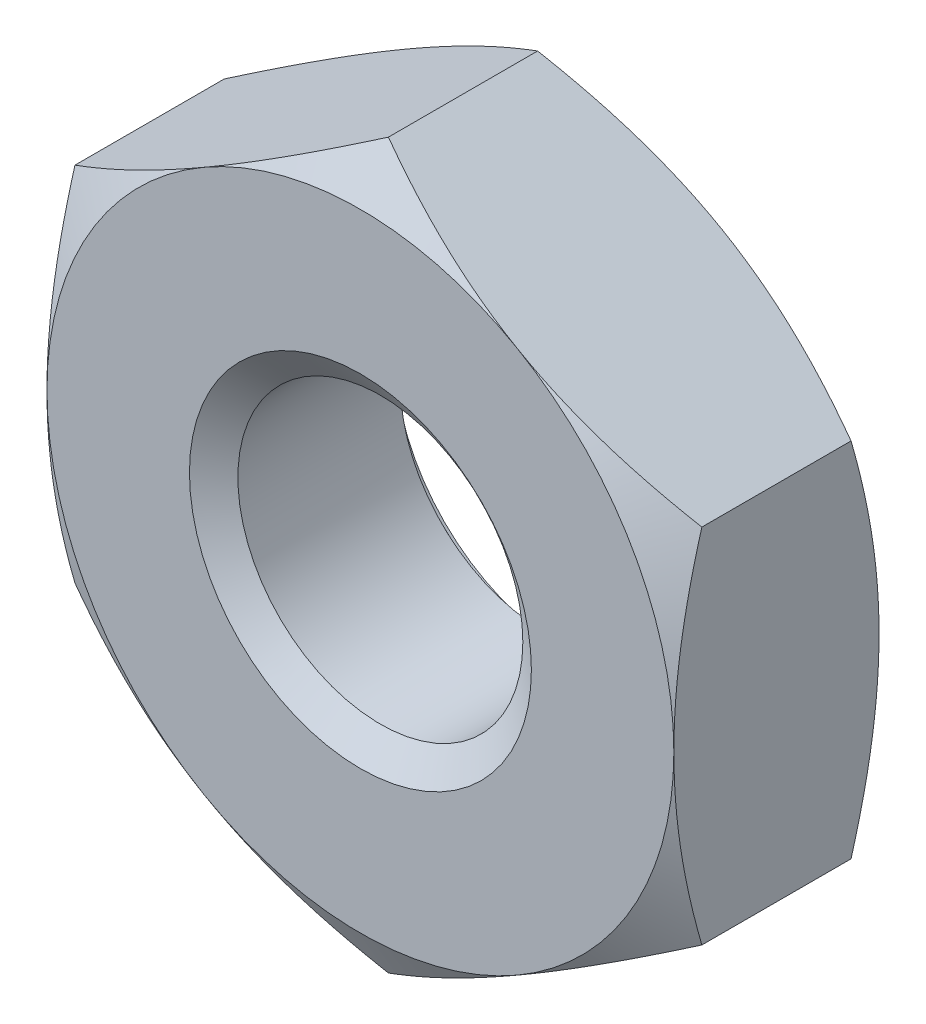
ISO-10303-21;
HEADER;
FILE_DESCRIPTION(('STEP AP214'),'2;1');
FILE_NAME('part.step','',(''),(''),'','','');
FILE_SCHEMA(('AUTOMOTIVE_DESIGN { 1 0 10303 214 1 1 1 1 }'));
ENDSEC;
DATA;
#1=APPLICATION_CONTEXT('core data for automotive mechanical design processes');
#2=APPLICATION_PROTOCOL_DEFINITION('international standard','automotive_design',2000,#1);
#3=PRODUCT_CONTEXT('',#1,'mechanical');
#4=PRODUCT('Part','Part','',(#3));
#5=PRODUCT_RELATED_PRODUCT_CATEGORY('part','',(#4));
#6=PRODUCT_DEFINITION_FORMATION('','',#4);
#7=PRODUCT_DEFINITION_CONTEXT('part definition',#1,'design');
#8=PRODUCT_DEFINITION('design','',#6,#7);
#9=PRODUCT_DEFINITION_SHAPE('','',#8);
#10=(LENGTH_UNIT() NAMED_UNIT(*) SI_UNIT(.MILLI.,.METRE.));
#11=(NAMED_UNIT(*) PLANE_ANGLE_UNIT() SI_UNIT($,.RADIAN.));
#12=(NAMED_UNIT(*) SI_UNIT($,.STERADIAN.) SOLID_ANGLE_UNIT());
#13=UNCERTAINTY_MEASURE_WITH_UNIT(LENGTH_MEASURE(1.E-05),#10,'distance_accuracy_value','');
#14=(GEOMETRIC_REPRESENTATION_CONTEXT(3) GLOBAL_UNCERTAINTY_ASSIGNED_CONTEXT((#13)) GLOBAL_UNIT_ASSIGNED_CONTEXT((#10,
#11,#12)) REPRESENTATION_CONTEXT('',''));
#15=CARTESIAN_POINT('',(0.,0.,0.));
#16=DIRECTION('',(0.,0.,1.));
#17=DIRECTION('',(1.,0.,0.));
#18=AXIS2_PLACEMENT_3D('',#15,#16,#17);
#19=CARTESIAN_POINT('',(0.,0.,-1.8));
#20=DIRECTION('',(0.,0.,1.));
#21=DIRECTION('',(1.,0.,0.));
#22=AXIS2_PLACEMENT_3D('',#19,#20,#21);
#23=CYLINDRICAL_SURFACE('',#22,1.25);
#24=CARTESIAN_POINT('',(0.,0.,-0.175051884552433));
#25=DIRECTION('',(0.,0.,1.));
#26=DIRECTION('',(1.,0.,0.));
#27=AXIS2_PLACEMENT_3D('',#24,#25,#26);
#28=CIRCLE('',#27,1.25);
#29=CARTESIAN_POINT('',(1.25,0.,-0.175051884552433));
#30=VERTEX_POINT('',#29);
#31=EDGE_CURVE('E166',#30,#30,#28,.F.);
#32=ORIENTED_EDGE('',*,*,#31,.F.);
#33=EDGE_LOOP('',(#32));
#34=FACE_BOUND('',#33,.T.);
#35=CARTESIAN_POINT('',(0.,0.,-1.59954811544757));
#36=DIRECTION('',(0.,0.,-1.));
#37=DIRECTION('',(-1.,0.,0.));
#38=AXIS2_PLACEMENT_3D('',#35,#36,#37);
#39=CIRCLE('',#38,1.25);
#40=CARTESIAN_POINT('',(-1.25,0.,-1.59954811544757));
#41=VERTEX_POINT('',#40);
#42=EDGE_CURVE('E31',#41,#41,#39,.F.);
#43=ORIENTED_EDGE('',*,*,#42,.F.);
#44=EDGE_LOOP('',(#43));
#45=FACE_BOUND('',#44,.T.);
#46=ADVANCED_FACE('F26',(#34,#45),#23,.F.);
#47=CARTESIAN_POINT('',(0.,3.17542648054295,-1.8));
#48=DIRECTION('',(0.,0.,-1.));
#49=DIRECTION('',(-1.,0.,0.));
#50=AXIS2_PLACEMENT_3D('',#47,#48,#49);
#51=PLANE('',#50);
#52=CARTESIAN_POINT('',(0.,0.,-1.8));
#53=DIRECTION('',(0.,0.,-1.));
#54=DIRECTION('',(-1.,0.,0.));
#55=AXIS2_PLACEMENT_3D('',#52,#53,#54);
#56=CIRCLE('',#55,2.75);
#57=CARTESIAN_POINT('',(-2.75,0.,-1.8));
#58=VERTEX_POINT('',#57);
#59=CARTESIAN_POINT('',(-1.37500000000002,-2.3815698604072,-1.8));
#60=VERTEX_POINT('',#59);
#61=EDGE_CURVE('E162',#58,#60,#56,.F.);
#62=ORIENTED_EDGE('',*,*,#61,.F.);
#63=CARTESIAN_POINT('',(-1.37500000000001,2.3815698604072,-1.8));
#64=VERTEX_POINT('',#63);
#65=EDGE_CURVE('E144',#64,#58,#56,.F.);
#66=ORIENTED_EDGE('',*,*,#65,.F.);
#67=CARTESIAN_POINT('',(1.37500000000002,2.38156986040719,-1.8));
#68=VERTEX_POINT('',#67);
#69=EDGE_CURVE('E161',#68,#64,#56,.F.);
#70=ORIENTED_EDGE('',*,*,#69,.F.);
#71=CARTESIAN_POINT('',(0.,0.,-1.8));
#72=DIRECTION('',(0.,0.,1.));
#73=DIRECTION('',(1.,0.,0.));
#74=AXIS2_PLACEMENT_3D('',#71,#72,#73);
#75=CIRCLE('',#74,2.75);
#76=CARTESIAN_POINT('',(2.75,0.,-1.8));
#77=VERTEX_POINT('',#76);
#78=EDGE_CURVE('E236',#77,#68,#75,.T.);
#79=ORIENTED_EDGE('',*,*,#78,.F.);
#80=CARTESIAN_POINT('',(1.375,-2.3815698604072,-1.8));
#81=VERTEX_POINT('',#80);
#82=EDGE_CURVE('E368',#81,#77,#56,.F.);
#83=ORIENTED_EDGE('',*,*,#82,.F.);
#84=EDGE_CURVE('E389',#60,#81,#56,.F.);
#85=ORIENTED_EDGE('',*,*,#84,.F.);
#86=EDGE_LOOP('',(#62,#66,#70,#79,#83,#85));
#87=FACE_BOUND('',#86,.T.);
#88=CARTESIAN_POINT('',(0.,0.,-1.8));
#89=DIRECTION('',(0.,0.,-1.));
#90=DIRECTION('',(-1.,0.,0.));
#91=AXIS2_PLACEMENT_3D('',#88,#89,#90);
#92=CIRCLE('',#91,1.5);
#93=CARTESIAN_POINT('',(-1.5,0.,-1.8));
#94=VERTEX_POINT('',#93);
#95=EDGE_CURVE('E169',#94,#94,#92,.F.);
#96=ORIENTED_EDGE('',*,*,#95,.T.);
#97=EDGE_LOOP('',(#96));
#98=FACE_BOUND('',#97,.T.);
#99=ADVANCED_FACE('F241',(#87,#98),#51,.T.);
#100=CARTESIAN_POINT('',(0.,3.17542648054295,0.));
#101=DIRECTION('',(0.,0.,-1.));
#102=DIRECTION('',(-1.,0.,0.));
#103=AXIS2_PLACEMENT_3D('',#100,#101,#102);
#104=PLANE('',#103);
#105=CARTESIAN_POINT('',(0.,0.,0.));
#106=DIRECTION('',(0.,0.,-1.));
#107=DIRECTION('',(-1.,0.,0.));
#108=AXIS2_PLACEMENT_3D('',#105,#106,#107);
#109=CIRCLE('',#108,2.75);
#110=CARTESIAN_POINT('',(-2.75,0.,0.));
#111=VERTEX_POINT('',#110);
#112=CARTESIAN_POINT('',(-1.37500000000001,2.3815698604072,0.));
#113=VERTEX_POINT('',#112);
#114=EDGE_CURVE('E11',#111,#113,#109,.T.);
#115=ORIENTED_EDGE('',*,*,#114,.F.);
#116=CARTESIAN_POINT('',(-1.37500000000002,-2.3815698604072,0.));
#117=VERTEX_POINT('',#116);
#118=EDGE_CURVE('E38',#117,#111,#109,.T.);
#119=ORIENTED_EDGE('',*,*,#118,.F.);
#120=CARTESIAN_POINT('',(1.375,-2.3815698604072,0.));
#121=VERTEX_POINT('',#120);
#122=EDGE_CURVE('E165',#121,#117,#109,.T.);
#123=ORIENTED_EDGE('',*,*,#122,.F.);
#124=CARTESIAN_POINT('',(2.75,0.,0.));
#125=VERTEX_POINT('',#124);
#126=EDGE_CURVE('E334',#125,#121,#109,.T.);
#127=ORIENTED_EDGE('',*,*,#126,.F.);
#128=CARTESIAN_POINT('',(0.,0.,0.));
#129=DIRECTION('',(0.,0.,1.));
#130=DIRECTION('',(1.,0.,0.));
#131=AXIS2_PLACEMENT_3D('',#128,#129,#130);
#132=CIRCLE('',#131,2.75);
#133=CARTESIAN_POINT('',(1.37500000000002,2.38156986040719,0.));
#134=VERTEX_POINT('',#133);
#135=EDGE_CURVE('E120',#125,#134,#132,.T.);
#136=ORIENTED_EDGE('',*,*,#135,.T.);
#137=EDGE_CURVE('E36',#113,#134,#109,.T.);
#138=ORIENTED_EDGE('',*,*,#137,.F.);
#139=EDGE_LOOP('',(#115,#119,#123,#127,#136,#138));
#140=FACE_BOUND('',#139,.T.);
#141=CARTESIAN_POINT('',(0.,0.,0.));
#142=DIRECTION('',(0.,0.,1.));
#143=DIRECTION('',(1.,0.,0.));
#144=AXIS2_PLACEMENT_3D('',#141,#142,#143);
#145=CIRCLE('',#144,1.5);
#146=CARTESIAN_POINT('',(1.5,0.,0.));
#147=VERTEX_POINT('',#146);
#148=EDGE_CURVE('E168',#147,#147,#145,.T.);
#149=ORIENTED_EDGE('',*,*,#148,.F.);
#150=EDGE_LOOP('',(#149));
#151=FACE_BOUND('',#150,.T.);
#152=ADVANCED_FACE('F294',(#140,#151),#104,.F.);
#153=CARTESIAN_POINT('',(0.,3.17542648054295,-1.8));
#154=DIRECTION('',(-0.500000000000004,0.866025403784436,0.));
#155=DIRECTION('',(-0.866025403784437,-0.500000000000004,0.));
#156=AXIS2_PLACEMENT_3D('',#153,#154,#155);
#157=PLANE('',#156);
#158=DIRECTION('',(0.,0.,1.));
#159=VECTOR('',#158,1.);
#160=CARTESIAN_POINT('',(-2.75,1.58771324027146,-1.8));
#161=LINE('',#160,#159);
#162=CARTESIAN_POINT('',(-2.75,1.58771324027149,-1.55437990693813));
#163=VERTEX_POINT('',#162);
#164=CARTESIAN_POINT('',(-2.75,1.58771324027146,-0.24562009306186));
#165=VERTEX_POINT('',#164);
#166=EDGE_CURVE('E156',#163,#165,#161,.T.);
#167=ORIENTED_EDGE('',*,*,#166,.T.);
#168=CARTESIAN_POINT('',(-2.7502,1.58759777021762,-0.245686763364758));
#169=CARTESIAN_POINT('',(-2.62935077934009,1.65737010029698,-0.205387662249261));
#170=CARTESIAN_POINT('',(-2.50745839737737,1.72774469983532,-0.16873690259766));
#171=CARTESIAN_POINT('',(-2.26156287327211,1.86971254687002,-0.104762182969799));
#172=CARTESIAN_POINT('',(-2.13755536142615,1.94130831721582,-0.0774608556744953));
#173=CARTESIAN_POINT('',(-1.89107720202406,2.08361254889598,-0.0349617452941148));
#174=CARTESIAN_POINT('',(-1.76864448141258,2.15429911309863,-0.0194811186224556));
#175=CARTESIAN_POINT('',(-1.52320285763109,2.29600490065922,-0.000999397369938588));
#176=CARTESIAN_POINT('',(-1.40019484676709,2.36702360884403,0.00201700053740174));
#177=CARTESIAN_POINT('',(-1.17034121338921,2.49972966594897,-0.00425314542854554));
#178=CARTESIAN_POINT('',(-1.06346120874598,2.56143686540072,-0.0120001542767013));
#179=CARTESIAN_POINT('',(-0.85039753266525,2.68444923614047,-0.0365551810643547));
#180=CARTESIAN_POINT('',(-0.744214598351109,2.74575398185008,-0.0533715896505712));
#181=CARTESIAN_POINT('',(-0.530711510606813,2.86902004703207,-0.0954119223459587));
#182=CARTESIAN_POINT('',(-0.42341838385714,2.93096576264319,-0.120814080687234));
#183=CARTESIAN_POINT('',(-0.210432520715942,3.05393320806134,-0.178467225839986));
#184=CARTESIAN_POINT('',(-0.104737054973339,3.11495651365996,-0.210704663298988));
#185=CARTESIAN_POINT('',(0.00020000000000939,3.17554195059679,-0.245686763364767));
#186=B_SPLINE_CURVE_WITH_KNOTS('',3,(#168,#169,#170,#171,#172,#173,#174,#175,#176,#177,#178,
#179,#180,#181,#182,#183,#184,#185),.UNSPECIFIED.,.F.,.F.,(4,2,2,2,2,2,2,2,4),(0.,
0.435912828725888,0.872873557116332,1.29901931904671,1.72464171213573,2.09526089052938,
2.46622354066375,2.84541551798559,3.22386274754526),.UNSPECIFIED.);
#187=EDGE_CURVE('E125',#165,#113,#186,.T.);
#188=ORIENTED_EDGE('',*,*,#187,.T.);
#189=CARTESIAN_POINT('',(0.,3.17542648054295,-0.245620093061869));
#190=VERTEX_POINT('',#189);
#191=EDGE_CURVE('E45',#113,#190,#186,.T.);
#192=ORIENTED_EDGE('',*,*,#191,.T.);
#193=DIRECTION('',(0.,0.,1.));
#194=VECTOR('',#193,1.);
#195=CARTESIAN_POINT('',(0.,3.17542648054295,-1.8));
#196=LINE('',#195,#194);
#197=CARTESIAN_POINT('',(0.,3.17542648054295,-1.55437990693813));
#198=VERTEX_POINT('',#197);
#199=EDGE_CURVE('E141',#198,#190,#196,.T.);
#200=ORIENTED_EDGE('',*,*,#199,.F.);
#201=CARTESIAN_POINT('',(-2.7502,1.58759777021762,-1.55431323663524));
#202=CARTESIAN_POINT('',(-2.62935077934009,1.65737010029698,-1.59461233775074));
#203=CARTESIAN_POINT('',(-2.50745839737737,1.72774469983532,-1.63126309740234));
#204=CARTESIAN_POINT('',(-2.26156287327211,1.86971254687002,-1.6952378170302));
#205=CARTESIAN_POINT('',(-2.13755536142615,1.94130831721582,-1.7225391443255));
#206=CARTESIAN_POINT('',(-1.89107720202406,2.08361254889598,-1.76503825470588));
#207=CARTESIAN_POINT('',(-1.76864448141259,2.15429911309863,-1.78051888137754));
#208=CARTESIAN_POINT('',(-1.52320285763109,2.29600490065922,-1.79900060263006));
#209=CARTESIAN_POINT('',(-1.40019484676709,2.36702360884403,-1.8020170005374));
#210=CARTESIAN_POINT('',(-1.17034121338921,2.49972966594897,-1.79574685457145));
#211=CARTESIAN_POINT('',(-1.06346120874598,2.56143686540072,-1.7879998457233));
#212=CARTESIAN_POINT('',(-0.85039753266525,2.68444923614047,-1.76344481893564));
#213=CARTESIAN_POINT('',(-0.744214598351109,2.74575398185008,-1.74662841034943));
#214=CARTESIAN_POINT('',(-0.530711510606812,2.86902004703207,-1.70458807765404));
#215=CARTESIAN_POINT('',(-0.42341838385714,2.93096576264319,-1.67918591931277));
#216=CARTESIAN_POINT('',(-0.210432520715942,3.05393320806134,-1.62153277416001));
#217=CARTESIAN_POINT('',(-0.104737054973339,3.11495651365996,-1.58929533670101));
#218=CARTESIAN_POINT('',(0.000200000000009386,3.17554195059679,-1.55431323663523));
#219=B_SPLINE_CURVE_WITH_KNOTS('',3,(#201,#202,#203,#204,#205,#206,#207,#208,#209,#210,#211,
#212,#213,#214,#215,#216,#217,#218),.UNSPECIFIED.,.F.,.F.,(4,2,2,2,2,2,2,2,4),(0.,
0.435912828725888,0.872873557116332,1.29901931904671,1.72464171213573,2.09526089052938,
2.46622354066375,2.84541551798559,3.22386274754526),.UNSPECIFIED.);
#220=EDGE_CURVE('E159',#64,#198,#219,.T.);
#221=ORIENTED_EDGE('',*,*,#220,.F.);
#222=EDGE_CURVE('E251',#163,#64,#219,.T.);
#223=ORIENTED_EDGE('',*,*,#222,.F.);
#224=EDGE_LOOP('',(#167,#188,#192,#200,#221,#223));
#225=FACE_BOUND('',#224,.T.);
#226=ADVANCED_FACE('F28',(#225),#157,.T.);
#227=CARTESIAN_POINT('',(2.75,1.58771324027145,-1.8));
#228=DIRECTION('',(0.500000000000009,0.866025403784433,0.));
#229=DIRECTION('',(-0.866025403784433,0.500000000000009,0.));
#230=AXIS2_PLACEMENT_3D('',#227,#228,#229);
#231=PLANE('',#230);
#232=ORIENTED_EDGE('',*,*,#199,.T.);
#233=CARTESIAN_POINT('',(-0.000199999999990853,3.17554195059679,-0.245686763364767));
#234=CARTESIAN_POINT('',(0.120649220659915,3.10576962051743,-0.20538766224927));
#235=CARTESIAN_POINT('',(0.242541602622642,3.03539502097909,-0.168736902597668));
#236=CARTESIAN_POINT('',(0.4884371267279,2.89342717394439,-0.104762182969804));
#237=CARTESIAN_POINT('',(0.612444638573863,2.82183140359859,-0.0774608556744997));
#238=CARTESIAN_POINT('',(0.85892279797595,2.67952717191842,-0.0349617452941176));
#239=CARTESIAN_POINT('',(0.981355518587423,2.60884060771577,-0.0194811186224581));
#240=CARTESIAN_POINT('',(1.22679714236892,2.46713482015518,-0.000999397369939371));
#241=CARTESIAN_POINT('',(1.34980515323292,2.39611611197037,0.00201700053740226));
#242=CARTESIAN_POINT('',(1.5796587866108,2.26341005486543,-0.00425314542854361));
#243=CARTESIAN_POINT('',(1.68653879125403,2.20170285541368,-0.012000154276699));
#244=CARTESIAN_POINT('',(1.89960246733475,2.07869048467393,-0.0365551810643508));
#245=CARTESIAN_POINT('',(2.00578540164889,2.01738573896432,-0.0533715896505661));
#246=CARTESIAN_POINT('',(2.21928848939319,1.89411967378233,-0.0954119223459518));
#247=CARTESIAN_POINT('',(2.32658161614286,1.83217395817121,-0.120814080687226));
#248=CARTESIAN_POINT('',(2.53956747928405,1.70920651275305,-0.178467225839977));
#249=CARTESIAN_POINT('',(2.64526294502666,1.64818320715444,-0.210704663298978));
#250=CARTESIAN_POINT('',(2.7502,1.58759777021761,-0.245686763364756));
#251=B_SPLINE_CURVE_WITH_KNOTS('',3,(#233,#234,#235,#236,#237,#238,#239,#240,#241,#242,#243,
#244,#245,#246,#247,#248,#249,#250),.UNSPECIFIED.,.F.,.F.,(4,2,2,2,2,2,2,2,4),(0.,
0.43591282872589,0.872873557116336,1.29901931904672,1.72464171213574,2.09526089052938,
2.46622354066375,2.84541551798558,3.22386274754526),.UNSPECIFIED.);
#252=EDGE_CURVE('E135',#190,#134,#251,.T.);
#253=ORIENTED_EDGE('',*,*,#252,.T.);
#254=CARTESIAN_POINT('',(2.75,1.58771324027149,-0.245620093061869));
#255=VERTEX_POINT('',#254);
#256=EDGE_CURVE('E52',#134,#255,#251,.T.);
#257=ORIENTED_EDGE('',*,*,#256,.T.);
#258=DIRECTION('',(0.,0.,1.));
#259=VECTOR('',#258,1.);
#260=CARTESIAN_POINT('',(2.75,1.58771324027145,-1.8));
#261=LINE('',#260,#259);
#262=CARTESIAN_POINT('',(2.75,1.58771324027149,-1.55437990693813));
#263=VERTEX_POINT('',#262);
#264=EDGE_CURVE('E134',#263,#255,#261,.T.);
#265=ORIENTED_EDGE('',*,*,#264,.F.);
#266=CARTESIAN_POINT('',(-0.000199999999990853,3.17554195059679,-1.55431323663523));
#267=CARTESIAN_POINT('',(0.120649220659915,3.10576962051743,-1.59461233775073));
#268=CARTESIAN_POINT('',(0.242541602622642,3.03539502097909,-1.63126309740233));
#269=CARTESIAN_POINT('',(0.4884371267279,2.89342717394439,-1.6952378170302));
#270=CARTESIAN_POINT('',(0.612444638573863,2.82183140359859,-1.7225391443255));
#271=CARTESIAN_POINT('',(0.85892279797595,2.67952717191842,-1.76503825470588));
#272=CARTESIAN_POINT('',(0.981355518587423,2.60884060771577,-1.78051888137754));
#273=CARTESIAN_POINT('',(1.22679714236892,2.46713482015518,-1.79900060263006));
#274=CARTESIAN_POINT('',(1.34980515323292,2.39611611197037,-1.8020170005374));
#275=CARTESIAN_POINT('',(1.5796587866108,2.26341005486543,-1.79574685457146));
#276=CARTESIAN_POINT('',(1.68653879125403,2.20170285541368,-1.7879998457233));
#277=CARTESIAN_POINT('',(1.89960246733475,2.07869048467393,-1.76344481893565));
#278=CARTESIAN_POINT('',(2.00578540164889,2.01738573896432,-1.74662841034943));
#279=CARTESIAN_POINT('',(2.21928848939319,1.89411967378233,-1.70458807765405));
#280=CARTESIAN_POINT('',(2.32658161614286,1.83217395817121,-1.67918591931277));
#281=CARTESIAN_POINT('',(2.53956747928405,1.70920651275305,-1.62153277416002));
#282=CARTESIAN_POINT('',(2.64526294502666,1.64818320715444,-1.58929533670102));
#283=CARTESIAN_POINT('',(2.7502,1.58759777021761,-1.55431323663524));
#284=B_SPLINE_CURVE_WITH_KNOTS('',3,(#266,#267,#268,#269,#270,#271,#272,#273,#274,#275,#276,
#277,#278,#279,#280,#281,#282,#283),.UNSPECIFIED.,.F.,.F.,(4,2,2,2,2,2,2,2,4),(0.,
0.43591282872589,0.872873557116336,1.29901931904672,1.72464171213574,2.09526089052938,
2.46622354066375,2.84541551798558,3.22386274754526),.UNSPECIFIED.);
#285=EDGE_CURVE('E245',#68,#263,#284,.T.);
#286=ORIENTED_EDGE('',*,*,#285,.F.);
#287=EDGE_CURVE('E250',#198,#68,#284,.T.);
#288=ORIENTED_EDGE('',*,*,#287,.F.);
#289=EDGE_LOOP('',(#232,#253,#257,#265,#286,#288));
#290=FACE_BOUND('',#289,.T.);
#291=ADVANCED_FACE('F132',(#290),#231,.T.);
#292=CARTESIAN_POINT('',(2.75,1.58771324027145,-1.8));
#293=DIRECTION('',(-1.,0.,0.));
#294=DIRECTION('',(0.,0.,1.));
#295=AXIS2_PLACEMENT_3D('',#292,#293,#294);
#296=PLANE('',#295);
#297=CARTESIAN_POINT('',(2.75,-4.2108494930968,-1.31594843960296));
#298=CARTESIAN_POINT('',(2.75,-4.09010894214094,-1.25759993615226));
#299=CARTESIAN_POINT('',(2.75,-3.96908292065513,-1.19983146511761));
#300=CARTESIAN_POINT('',(2.75,-3.72630558284847,-1.08578603842307));
#301=CARTESIAN_POINT('',(2.75,-3.60455414536204,-1.02950934100249));
#302=CARTESIAN_POINT('',(2.75,-3.35951393034358,-0.918482443352776));
#303=CARTESIAN_POINT('',(2.75,-3.2362203423644,-0.863742821605857));
#304=CARTESIAN_POINT('',(2.75,-2.98861980138747,-0.756614777476472));
#305=CARTESIAN_POINT('',(2.75,-2.86431290161185,-0.704226232536781));
#306=CARTESIAN_POINT('',(2.75,-2.61294485887175,-0.601803572146139));
#307=CARTESIAN_POINT('',(2.75,-2.48586863815658,-0.551806257898409));
#308=CARTESIAN_POINT('',(2.75,-2.23021732171544,-0.455727408784615));
#309=CARTESIAN_POINT('',(2.75,-2.10164206103367,-0.409646309576985));
#310=CARTESIAN_POINT('',(2.75,-1.8430521879947,-0.322638077046243));
#311=CARTESIAN_POINT('',(2.75,-1.71304130052586,-0.2816999864139));
#312=CARTESIAN_POINT('',(2.75,-1.45117125062151,-0.206307307624358));
#313=CARTESIAN_POINT('',(2.75,-1.31931268690205,-0.171850669152776));
#314=CARTESIAN_POINT('',(2.75,-1.05365722480015,-0.111093671530912));
#315=CARTESIAN_POINT('',(2.75,-0.919859820217619,-0.0847954840951284));
#316=CARTESIAN_POINT('',(2.75,-0.650651874037408,-0.0421260371966166));
#317=CARTESIAN_POINT('',(2.75,-0.515241331013621,-0.0257547865105478));
#318=CARTESIAN_POINT('',(2.75,-0.244373242869236,-0.00438749654024078));
#319=CARTESIAN_POINT('',(2.75,-0.108921526377158,0.000680556773213311));
#320=CARTESIAN_POINT('',(2.75,0.161887058855111,-0.000827795632673369));
#321=CARTESIAN_POINT('',(2.75,0.297243943089618,-0.00740117868555452));
#322=CARTESIAN_POINT('',(2.75,0.52838543671752,-0.0281041300468435));
#323=CARTESIAN_POINT('',(2.75,0.624425050137477,-0.0395376410301873));
#324=CARTESIAN_POINT('',(2.75,0.815762399811518,-0.0675217196133488));
#325=CARTESIAN_POINT('',(2.75,0.91106001663194,-0.0840730942276794));
#326=CARTESIAN_POINT('',(2.75,1.19576218748914,-0.14053536127828));
#327=CARTESIAN_POINT('',(2.75,1.38383224738494,-0.187239859417288));
#328=CARTESIAN_POINT('',(2.75,1.66525048947482,-0.267792497030571));
#329=CARTESIAN_POINT('',(2.75,1.76006556248555,-0.296803334995493));
#330=CARTESIAN_POINT('',(2.75,1.94870609382212,-0.357695648906578));
#331=CARTESIAN_POINT('',(2.75,2.04253218553692,-0.389575144878494));
#332=CARTESIAN_POINT('',(2.75,2.22880240354981,-0.455541418186437));
#333=CARTESIAN_POINT('',(2.75,2.32125133588448,-0.489614761455521));
#334=CARTESIAN_POINT('',(2.75,2.50543192042625,-0.559761368231096));
#335=CARTESIAN_POINT('',(2.75,2.59716326539575,-0.595835440037304));
#336=CARTESIAN_POINT('',(2.75,2.68856293053342,-0.63271244199747));
#337=B_SPLINE_CURVE_WITH_KNOTS('',3,(#297,#298,#299,#300,#301,#302,#303,#304,#305,#306,#307,
#308,#309,#310,#311,#312,#313,#314,#315,#316,#317,#318,#319,#320,#321,#322,#323,#324,#325,#326,
#327,#328,#329,#330,#331,#332,#333,#334,#335,#336),.UNSPECIFIED.,.F.,.F.,(4,2,2,2,2,2,2,2,2,2,2,
2,2,2,2,2,2,2,2,4),(0.,0.402305607365938,0.804680408537,1.20935783819118,1.61401414820819,
2.02363838185771,2.4333081245735,2.84208969479602,3.25074173456638,3.65950246109145,
4.06826354901185,4.47441284024652,4.88045669141174,5.17046846817548,5.46052599902454,
6.04107275309884,6.33851131304662,6.63574613017455,6.93130791005792,7.22698998004823),.UNSPECIFIED.);
#338=CARTESIAN_POINT('',(2.74999999999999,-1.58771324027152,-0.245620093061869));
#339=VERTEX_POINT('',#338);
#340=EDGE_CURVE('E127',#339,#125,#337,.T.);
#341=ORIENTED_EDGE('',*,*,#340,.F.);
#342=DIRECTION('',(0.,0.,1.));
#343=VECTOR('',#342,1.);
#344=CARTESIAN_POINT('',(2.75,-1.58771324027151,-1.8));
#345=LINE('',#344,#343);
#346=CARTESIAN_POINT('',(2.74999999999999,-1.58771324027152,-1.55437990693813));
#347=VERTEX_POINT('',#346);
#348=EDGE_CURVE('E142',#347,#339,#345,.T.);
#349=ORIENTED_EDGE('',*,*,#348,.F.);
#350=CARTESIAN_POINT('',(2.75,-4.2108494930968,-0.484051560397038));
#351=CARTESIAN_POINT('',(2.75,-4.09010894214094,-0.542400063847735));
#352=CARTESIAN_POINT('',(2.75,-3.96908292065513,-0.600168534882393));
#353=CARTESIAN_POINT('',(2.75,-3.72630558284847,-0.71421396157693));
#354=CARTESIAN_POINT('',(2.75,-3.60455414536204,-0.770490658997509));
#355=CARTESIAN_POINT('',(2.75,-3.35951393034358,-0.881517556647223));
#356=CARTESIAN_POINT('',(2.75,-3.2362203423644,-0.936257178394143));
#357=CARTESIAN_POINT('',(2.75,-2.98861980138747,-1.04338522252353));
#358=CARTESIAN_POINT('',(2.75,-2.86431290161185,-1.09577376746322));
#359=CARTESIAN_POINT('',(2.75,-2.61294485887175,-1.19819642785386));
#360=CARTESIAN_POINT('',(2.75,-2.48586863815658,-1.24819374210159));
#361=CARTESIAN_POINT('',(2.75,-2.23021732171544,-1.34427259121538));
#362=CARTESIAN_POINT('',(2.75,-2.10164206103367,-1.39035369042301));
#363=CARTESIAN_POINT('',(2.75,-1.8430521879947,-1.47736192295376));
#364=CARTESIAN_POINT('',(2.75,-1.71304130052586,-1.5183000135861));
#365=CARTESIAN_POINT('',(2.75,-1.45117125062151,-1.59369269237564));
#366=CARTESIAN_POINT('',(2.75,-1.31931268690205,-1.62814933084722));
#367=CARTESIAN_POINT('',(2.75,-1.05365722480015,-1.68890632846909));
#368=CARTESIAN_POINT('',(2.75,-0.919859820217619,-1.71520451590487));
#369=CARTESIAN_POINT('',(2.75,-0.650651874037408,-1.75787396280338));
#370=CARTESIAN_POINT('',(2.75,-0.515241331013621,-1.77424521348945));
#371=CARTESIAN_POINT('',(2.75,-0.244373242869236,-1.79561250345976));
#372=CARTESIAN_POINT('',(2.75,-0.108921526377158,-1.80068055677321));
#373=CARTESIAN_POINT('',(2.75,0.161887058855111,-1.79917220436733));
#374=CARTESIAN_POINT('',(2.75,0.297243943089618,-1.79259882131444));
#375=CARTESIAN_POINT('',(2.75,0.52838543671752,-1.77189586995316));
#376=CARTESIAN_POINT('',(2.75,0.624425050137478,-1.76046235896981));
#377=CARTESIAN_POINT('',(2.75,0.815762399811519,-1.73247828038665));
#378=CARTESIAN_POINT('',(2.75,0.91106001663194,-1.71592690577232));
#379=CARTESIAN_POINT('',(2.75,1.19576218748914,-1.65946463872172));
#380=CARTESIAN_POINT('',(2.75,1.38383224738494,-1.61276014058271));
#381=CARTESIAN_POINT('',(2.75,1.66525048947482,-1.53220750296943));
#382=CARTESIAN_POINT('',(2.75,1.76006556248555,-1.50319666500451));
#383=CARTESIAN_POINT('',(2.75,1.94870609382212,-1.44230435109342));
#384=CARTESIAN_POINT('',(2.75,2.04253218553692,-1.41042485512151));
#385=CARTESIAN_POINT('',(2.75,2.22880240354981,-1.34445858181356));
#386=CARTESIAN_POINT('',(2.75,2.32125133588448,-1.31038523854448));
#387=CARTESIAN_POINT('',(2.75,2.50543192042625,-1.2402386317689));
#388=CARTESIAN_POINT('',(2.75,2.59716326539575,-1.20416455996269));
#389=CARTESIAN_POINT('',(2.75,2.68856293053342,-1.16728755800253));
#390=B_SPLINE_CURVE_WITH_KNOTS('',3,(#350,#351,#352,#353,#354,#355,#356,#357,#358,#359,#360,
#361,#362,#363,#364,#365,#366,#367,#368,#369,#370,#371,#372,#373,#374,#375,#376,#377,#378,#379,
#380,#381,#382,#383,#384,#385,#386,#387,#388,#389),.UNSPECIFIED.,.F.,.F.,(4,2,2,2,2,2,2,2,2,2,2,
2,2,2,2,2,2,2,2,4),(0.,0.402305607365938,0.804680408537,1.20935783819118,1.61401414820819,
2.02363838185771,2.4333081245735,2.84208969479601,3.25074173456638,3.65950246109145,
4.06826354901185,4.47441284024652,4.88045669141174,5.17046846817548,5.46052599902454,
6.04107275309884,6.33851131304662,6.63574613017455,6.93130791005792,7.22698998004823),.UNSPECIFIED.);
#391=EDGE_CURVE('E257',#347,#77,#390,.T.);
#392=ORIENTED_EDGE('',*,*,#391,.T.);
#393=EDGE_CURVE('E140',#77,#263,#390,.T.);
#394=ORIENTED_EDGE('',*,*,#393,.T.);
#395=ORIENTED_EDGE('',*,*,#264,.T.);
#396=EDGE_CURVE('E117',#125,#255,#337,.T.);
#397=ORIENTED_EDGE('',*,*,#396,.F.);
#398=EDGE_LOOP('',(#341,#349,#392,#394,#395,#397));
#399=FACE_BOUND('',#398,.T.);
#400=ADVANCED_FACE('F138',(#399),#296,.F.);
#401=CARTESIAN_POINT('',(0.,-3.17542648054299,-1.8));
#402=DIRECTION('',(0.500000000000002,-0.866025403784438,0.));
#403=DIRECTION('',(0.866025403784438,0.500000000000002,0.));
#404=AXIS2_PLACEMENT_3D('',#401,#402,#403);
#405=PLANE('',#404);
#406=ORIENTED_EDGE('',*,*,#348,.T.);
#407=CARTESIAN_POINT('',(2.7502,-1.58759777021767,-0.245686763364773));
#408=CARTESIAN_POINT('',(2.6293507793401,-1.65737010029702,-0.205387662249276));
#409=CARTESIAN_POINT('',(2.50745839737737,-1.72774469983537,-0.168736902597675));
#410=CARTESIAN_POINT('',(2.26156287327211,-1.86971254687006,-0.104762182969815));
#411=CARTESIAN_POINT('',(2.13755536142614,-1.94130831721587,-0.077460855674512));
#412=CARTESIAN_POINT('',(1.89107720202405,-2.08361254889603,-0.0349617452941329));
#413=CARTESIAN_POINT('',(1.76864448141258,-2.15429911309868,-0.0194811186224747));
#414=CARTESIAN_POINT('',(1.52320285763108,-2.29600490065927,-0.000999397369959157));
#415=CARTESIAN_POINT('',(1.40019484676708,-2.36702360884408,0.00201700053738071));
#416=CARTESIAN_POINT('',(1.1703412133892,-2.49972966594901,-0.00425314542856803));
#417=CARTESIAN_POINT('',(1.06346120874597,-2.56143686540077,-0.0120001542767245));
#418=CARTESIAN_POINT('',(0.850397532665244,-2.68444923614051,-0.0365551810643784));
#419=CARTESIAN_POINT('',(0.744214598351105,-2.74575398185012,-0.0533715896505946));
#420=CARTESIAN_POINT('',(0.530711510606812,-2.86902004703211,-0.0954119223459818));
#421=CARTESIAN_POINT('',(0.423418383857141,-2.93096576264323,-0.120814080687257));
#422=CARTESIAN_POINT('',(0.210432520715946,-3.05393320806138,-0.178467225840008));
#423=CARTESIAN_POINT('',(0.104737054973345,-3.11495651366,-0.210704663299009));
#424=CARTESIAN_POINT('',(-0.000200000000002054,-3.17554195059682,-0.245686763364787));
#425=B_SPLINE_CURVE_WITH_KNOTS('',3,(#407,#408,#409,#410,#411,#412,#413,#414,#415,#416,#417,
#418,#419,#420,#421,#422,#423,#424),.UNSPECIFIED.,.F.,.F.,(4,2,2,2,2,2,2,2,4),(0.,
0.435912828725891,0.872873557116338,1.29901931904672,1.72464171213575,2.09526089052939,
2.46622354066375,2.84541551798558,3.22386274754525),.UNSPECIFIED.);
#426=EDGE_CURVE('E337',#339,#121,#425,.T.);
#427=ORIENTED_EDGE('',*,*,#426,.T.);
#428=CARTESIAN_POINT('',(0.,-3.17542648054295,-0.245620093061869));
#429=VERTEX_POINT('',#428);
#430=EDGE_CURVE('E217',#121,#429,#425,.T.);
#431=ORIENTED_EDGE('',*,*,#430,.T.);
#432=DIRECTION('',(0.,0.,1.));
#433=VECTOR('',#432,1.);
#434=CARTESIAN_POINT('',(0.,-3.17542648054299,-1.8));
#435=LINE('',#434,#433);
#436=CARTESIAN_POINT('',(0.,-3.17542648054295,-1.55437990693813));
#437=VERTEX_POINT('',#436);
#438=EDGE_CURVE('E147',#437,#429,#435,.T.);
#439=ORIENTED_EDGE('',*,*,#438,.F.);
#440=CARTESIAN_POINT('',(2.7502,-1.58759777021767,-1.55431323663523));
#441=CARTESIAN_POINT('',(2.6293507793401,-1.65737010029702,-1.59461233775072));
#442=CARTESIAN_POINT('',(2.50745839737737,-1.72774469983537,-1.63126309740232));
#443=CARTESIAN_POINT('',(2.26156287327211,-1.86971254687006,-1.69523781703018));
#444=CARTESIAN_POINT('',(2.13755536142614,-1.94130831721587,-1.72253914432549));
#445=CARTESIAN_POINT('',(1.89107720202405,-2.08361254889603,-1.76503825470587));
#446=CARTESIAN_POINT('',(1.76864448141258,-2.15429911309868,-1.78051888137752));
#447=CARTESIAN_POINT('',(1.52320285763108,-2.29600490065927,-1.79900060263004));
#448=CARTESIAN_POINT('',(1.40019484676708,-2.36702360884408,-1.80201700053738));
#449=CARTESIAN_POINT('',(1.1703412133892,-2.49972966594901,-1.79574685457143));
#450=CARTESIAN_POINT('',(1.06346120874597,-2.56143686540077,-1.78799984572327));
#451=CARTESIAN_POINT('',(0.850397532665244,-2.68444923614051,-1.76344481893562));
#452=CARTESIAN_POINT('',(0.744214598351105,-2.74575398185012,-1.7466284103494));
#453=CARTESIAN_POINT('',(0.530711510606812,-2.86902004703211,-1.70458807765402));
#454=CARTESIAN_POINT('',(0.423418383857141,-2.93096576264323,-1.67918591931274));
#455=CARTESIAN_POINT('',(0.210432520715946,-3.05393320806138,-1.62153277415999));
#456=CARTESIAN_POINT('',(0.104737054973345,-3.11495651365999,-1.58929533670099));
#457=CARTESIAN_POINT('',(-0.000200000000002054,-3.17554195059682,-1.55431323663521));
#458=B_SPLINE_CURVE_WITH_KNOTS('',3,(#440,#441,#442,#443,#444,#445,#446,#447,#448,#449,#450,
#451,#452,#453,#454,#455,#456,#457),.UNSPECIFIED.,.F.,.F.,(4,2,2,2,2,2,2,2,4),(0.,
0.435912828725891,0.872873557116338,1.29901931904672,1.72464171213575,2.09526089052939,
2.46622354066375,2.84541551798558,3.22386274754525),.UNSPECIFIED.);
#459=EDGE_CURVE('E263',#81,#437,#458,.T.);
#460=ORIENTED_EDGE('',*,*,#459,.F.);
#461=EDGE_CURVE('E262',#347,#81,#458,.T.);
#462=ORIENTED_EDGE('',*,*,#461,.F.);
#463=EDGE_LOOP('',(#406,#427,#431,#439,#460,#462));
#464=FACE_BOUND('',#463,.T.);
#465=ADVANCED_FACE('F273',(#464),#405,.T.);
#466=CARTESIAN_POINT('',(-2.75,-1.58771324027149,-1.8));
#467=DIRECTION('',(-0.500000000000006,-0.866025403784435,0.));
#468=DIRECTION('',(0.866025403784435,-0.500000000000006,0.));
#469=AXIS2_PLACEMENT_3D('',#466,#467,#468);
#470=PLANE('',#469);
#471=ORIENTED_EDGE('',*,*,#438,.T.);
#472=CARTESIAN_POINT('',(0.000199999999997729,-3.17554195059682,-0.245686763364787));
#473=CARTESIAN_POINT('',(-0.120649220659909,-3.10576962051747,-0.205387662249289));
#474=CARTESIAN_POINT('',(-0.242541602622638,-3.03539502097912,-0.168736902597687));
#475=CARTESIAN_POINT('',(-0.4884371267279,-2.89342717394442,-0.104762182969823));
#476=CARTESIAN_POINT('',(-0.612444638573864,-2.82183140359862,-0.0774608556745188));
#477=CARTESIAN_POINT('',(-0.858922797975954,-2.67952717191846,-0.0349617452941363));
#478=CARTESIAN_POINT('',(-0.981355518587429,-2.6088406077158,-0.0194811186224764));
#479=CARTESIAN_POINT('',(-1.22679714236893,-2.46713482015521,-0.000999397369957663));
#480=CARTESIAN_POINT('',(-1.34980515323293,-2.3961161119704,0.00201700053738355));
#481=CARTESIAN_POINT('',(-1.57965878661081,-2.26341005486546,-0.00425314542856238));
#482=CARTESIAN_POINT('',(-1.68653879125404,-2.20170285541371,-0.0120001542767172));
#483=CARTESIAN_POINT('',(-1.89960246733476,-2.07869048467397,-0.0365551810643684));
#484=CARTESIAN_POINT('',(-2.0057854016489,-2.01738573896436,-0.0533715896505834));
#485=CARTESIAN_POINT('',(-2.21928848939319,-1.89411967378237,-0.0954119223459679));
#486=CARTESIAN_POINT('',(-2.32658161614286,-1.83217395817125,-0.120814080687241));
#487=CARTESIAN_POINT('',(-2.53956747928405,-1.7092065127531,-0.17846722583999));
#488=CARTESIAN_POINT('',(-2.64526294502665,-1.64818320715448,-0.21070466329899));
#489=CARTESIAN_POINT('',(-2.7502,-1.58759777021765,-0.245686763364767));
#490=B_SPLINE_CURVE_WITH_KNOTS('',3,(#472,#473,#474,#475,#476,#477,#478,#479,#480,#481,#482,
#483,#484,#485,#486,#487,#488,#489),.UNSPECIFIED.,.F.,.F.,(4,2,2,2,2,2,2,2,4),(0.,
0.435912828725895,0.872873557116345,1.29901931904673,1.72464171213576,2.0952608905294,
2.46622354066376,2.84541551798559,3.22386274754525),.UNSPECIFIED.);
#491=EDGE_CURVE('E340',#429,#117,#490,.T.);
#492=ORIENTED_EDGE('',*,*,#491,.T.);
#493=CARTESIAN_POINT('',(-2.75,-1.58771324027149,-0.245620093061869));
#494=VERTEX_POINT('',#493);
#495=EDGE_CURVE('E191',#117,#494,#490,.T.);
#496=ORIENTED_EDGE('',*,*,#495,.T.);
#497=DIRECTION('',(0.,0.,1.));
#498=VECTOR('',#497,1.);
#499=CARTESIAN_POINT('',(-2.75,-1.58771324027149,-1.8));
#500=LINE('',#499,#498);
#501=CARTESIAN_POINT('',(-2.75,-1.58771324027149,-1.55437990693813));
#502=VERTEX_POINT('',#501);
#503=EDGE_CURVE('E153',#502,#494,#500,.T.);
#504=ORIENTED_EDGE('',*,*,#503,.F.);
#505=CARTESIAN_POINT('',(0.000199999999997729,-3.17554195059682,-1.55431323663521));
#506=CARTESIAN_POINT('',(-0.120649220659909,-3.10576962051747,-1.59461233775071));
#507=CARTESIAN_POINT('',(-0.242541602622638,-3.03539502097912,-1.63126309740231));
#508=CARTESIAN_POINT('',(-0.4884371267279,-2.89342717394442,-1.69523781703018));
#509=CARTESIAN_POINT('',(-0.612444638573864,-2.82183140359862,-1.72253914432548));
#510=CARTESIAN_POINT('',(-0.858922797975954,-2.67952717191846,-1.76503825470586));
#511=CARTESIAN_POINT('',(-0.981355518587429,-2.6088406077158,-1.78051888137752));
#512=CARTESIAN_POINT('',(-1.22679714236893,-2.46713482015521,-1.79900060263004));
#513=CARTESIAN_POINT('',(-1.34980515323293,-2.3961161119704,-1.80201700053738));
#514=CARTESIAN_POINT('',(-1.57965878661081,-2.26341005486546,-1.79574685457144));
#515=CARTESIAN_POINT('',(-1.68653879125404,-2.20170285541371,-1.78799984572328));
#516=CARTESIAN_POINT('',(-1.89960246733476,-2.07869048467397,-1.76344481893563));
#517=CARTESIAN_POINT('',(-2.0057854016489,-2.01738573896436,-1.74662841034942));
#518=CARTESIAN_POINT('',(-2.21928848939319,-1.89411967378237,-1.70458807765403));
#519=CARTESIAN_POINT('',(-2.32658161614286,-1.83217395817125,-1.67918591931276));
#520=CARTESIAN_POINT('',(-2.53956747928405,-1.7092065127531,-1.62153277416001));
#521=CARTESIAN_POINT('',(-2.64526294502665,-1.64818320715448,-1.58929533670101));
#522=CARTESIAN_POINT('',(-2.7502,-1.58759777021765,-1.55431323663523));
#523=B_SPLINE_CURVE_WITH_KNOTS('',3,(#505,#506,#507,#508,#509,#510,#511,#512,#513,#514,#515,
#516,#517,#518,#519,#520,#521,#522),.UNSPECIFIED.,.F.,.F.,(4,2,2,2,2,2,2,2,4),(0.,
0.435912828725894,0.872873557116345,1.29901931904673,1.72464171213576,2.0952608905294,
2.46622354066376,2.84541551798559,3.22386274754525),.UNSPECIFIED.);
#524=EDGE_CURVE('E269',#60,#502,#523,.T.);
#525=ORIENTED_EDGE('',*,*,#524,.F.);
#526=EDGE_CURVE('E268',#437,#60,#523,.T.);
#527=ORIENTED_EDGE('',*,*,#526,.F.);
#528=EDGE_LOOP('',(#471,#492,#496,#504,#525,#527));
#529=FACE_BOUND('',#528,.T.);
#530=ADVANCED_FACE('F276',(#529),#470,.T.);
#531=CARTESIAN_POINT('',(-2.75,1.58771324027146,-1.8));
#532=DIRECTION('',(-1.,0.,0.));
#533=DIRECTION('',(0.,0.,1.));
#534=AXIS2_PLACEMENT_3D('',#531,#532,#533);
#535=PLANE('',#534);
#536=ORIENTED_EDGE('',*,*,#503,.T.);
#537=CARTESIAN_POINT('',(-2.75,-4.21084949309678,-1.31594843960295));
#538=CARTESIAN_POINT('',(-2.75,-4.09010894214092,-1.25759993615225));
#539=CARTESIAN_POINT('',(-2.75,-3.96908292065511,-1.1998314651176));
#540=CARTESIAN_POINT('',(-2.75,-3.72630558284846,-1.08578603842306));
#541=CARTESIAN_POINT('',(-2.75,-3.60455414536202,-1.02950934100248));
#542=CARTESIAN_POINT('',(-2.75,-3.35951393034357,-0.918482443352768));
#543=CARTESIAN_POINT('',(-2.75,-3.23622034236438,-0.863742821605848));
#544=CARTESIAN_POINT('',(-2.75,-2.98861980138745,-0.756614777476464));
#545=CARTESIAN_POINT('',(-2.75,-2.86431290161184,-0.704226232536773));
#546=CARTESIAN_POINT('',(-2.75,-2.61294485887174,-0.601803572146133));
#547=CARTESIAN_POINT('',(-2.75,-2.48586863815656,-0.551806257898402));
#548=CARTESIAN_POINT('',(-2.75,-2.23021732171543,-0.455727408784609));
#549=CARTESIAN_POINT('',(-2.75,-2.10164206103365,-0.409646309576979));
#550=CARTESIAN_POINT('',(-2.75,-1.84305218799469,-0.322638077046237));
#551=CARTESIAN_POINT('',(-2.75,-1.71304130052585,-0.281699986413894));
#552=CARTESIAN_POINT('',(-2.75,-1.45117125062149,-0.206307307624353));
#553=CARTESIAN_POINT('',(-2.75,-1.31931268690204,-0.171850669152771));
#554=CARTESIAN_POINT('',(-2.75,-1.05365722480014,-0.111093671530907));
#555=CARTESIAN_POINT('',(-2.75,-0.919859820217607,-0.0847954840951244));
#556=CARTESIAN_POINT('',(-2.75,-0.650651874037396,-0.0421260371966131));
#557=CARTESIAN_POINT('',(-2.75,-0.515241331013609,-0.0257547865105445));
#558=CARTESIAN_POINT('',(-2.75,-0.244373242869225,-0.00438749654023808));
#559=CARTESIAN_POINT('',(-2.75,-0.108921526377147,0.000680556773215618));
#560=CARTESIAN_POINT('',(-2.75,0.161887058855121,-0.000827795632671669));
#561=CARTESIAN_POINT('',(-2.75,0.297243943089627,-0.00740117868555302));
#562=CARTESIAN_POINT('',(-2.75,0.528385436717528,-0.0281041300468425));
#563=CARTESIAN_POINT('',(-2.75,0.624425050137486,-0.0395376410301865));
#564=CARTESIAN_POINT('',(-2.75,0.815762399811528,-0.0675217196133485));
#565=CARTESIAN_POINT('',(-2.75,0.911060016631949,-0.0840730942276793));
#566=CARTESIAN_POINT('',(-2.75,1.19576218748915,-0.14053536127828));
#567=CARTESIAN_POINT('',(-2.75,1.38383224738495,-0.187239859417289));
#568=CARTESIAN_POINT('',(-2.75,1.66525048947483,-0.267792497030572));
#569=CARTESIAN_POINT('',(-2.75,1.76006556248556,-0.296803334995494));
#570=CARTESIAN_POINT('',(-2.75,1.94870609382213,-0.35769564890658));
#571=CARTESIAN_POINT('',(-2.75,2.04253218553693,-0.389575144878495));
#572=CARTESIAN_POINT('',(-2.75,2.22880240354982,-0.45554141818644));
#573=CARTESIAN_POINT('',(-2.75,2.32125133588449,-0.489614761455524));
#574=CARTESIAN_POINT('',(-2.75,2.50543192042626,-0.5597613682311));
#575=CARTESIAN_POINT('',(-2.75,2.59716326539576,-0.595835440037308));
#576=CARTESIAN_POINT('',(-2.75,2.68856293053343,-0.632712441997474));
#577=B_SPLINE_CURVE_WITH_KNOTS('',3,(#537,#538,#539,#540,#541,#542,#543,#544,#545,#546,#547,
#548,#549,#550,#551,#552,#553,#554,#555,#556,#557,#558,#559,#560,#561,#562,#563,#564,#565,#566,
#567,#568,#569,#570,#571,#572,#573,#574,#575,#576),.UNSPECIFIED.,.F.,.F.,(4,2,2,2,2,2,2,2,2,2,2,
2,2,2,2,2,2,2,2,4),(0.,0.402305607365936,0.804680408536997,1.20935783819118,1.61401414820818,
2.0236383818577,2.43330812457349,2.84208969479601,3.25074173456637,3.65950246109144,
4.06826354901185,4.47441284024651,4.88045669141173,5.17046846817547,5.46052599902453,
6.04107275309883,6.33851131304661,6.63574613017454,6.93130791005792,7.22698998004822),.UNSPECIFIED.);
#578=EDGE_CURVE('E190',#494,#111,#577,.T.);
#579=ORIENTED_EDGE('',*,*,#578,.T.);
#580=EDGE_CURVE('E183',#111,#165,#577,.T.);
#581=ORIENTED_EDGE('',*,*,#580,.T.);
#582=ORIENTED_EDGE('',*,*,#166,.F.);
#583=CARTESIAN_POINT('',(-2.75,-4.21084949309678,-0.484051560397048));
#584=CARTESIAN_POINT('',(-2.75,-4.09010894214092,-0.542400063847746));
#585=CARTESIAN_POINT('',(-2.75,-3.96908292065511,-0.600168534882403));
#586=CARTESIAN_POINT('',(-2.75,-3.72630558284846,-0.714213961576939));
#587=CARTESIAN_POINT('',(-2.75,-3.60455414536202,-0.770490658997518));
#588=CARTESIAN_POINT('',(-2.75,-3.35951393034357,-0.881517556647232));
#589=CARTESIAN_POINT('',(-2.75,-3.23622034236438,-0.936257178394151));
#590=CARTESIAN_POINT('',(-2.75,-2.98861980138745,-1.04338522252354));
#591=CARTESIAN_POINT('',(-2.75,-2.86431290161184,-1.09577376746323));
#592=CARTESIAN_POINT('',(-2.75,-2.61294485887174,-1.19819642785387));
#593=CARTESIAN_POINT('',(-2.75,-2.48586863815656,-1.2481937421016));
#594=CARTESIAN_POINT('',(-2.75,-2.23021732171543,-1.34427259121539));
#595=CARTESIAN_POINT('',(-2.75,-2.10164206103365,-1.39035369042302));
#596=CARTESIAN_POINT('',(-2.75,-1.84305218799469,-1.47736192295376));
#597=CARTESIAN_POINT('',(-2.75,-1.71304130052585,-1.51830001358611));
#598=CARTESIAN_POINT('',(-2.75,-1.45117125062149,-1.59369269237565));
#599=CARTESIAN_POINT('',(-2.75,-1.31931268690204,-1.62814933084723));
#600=CARTESIAN_POINT('',(-2.75,-1.05365722480014,-1.68890632846909));
#601=CARTESIAN_POINT('',(-2.75,-0.919859820217607,-1.71520451590488));
#602=CARTESIAN_POINT('',(-2.75,-0.650651874037396,-1.75787396280339));
#603=CARTESIAN_POINT('',(-2.75,-0.51524133101361,-1.77424521348946));
#604=CARTESIAN_POINT('',(-2.75,-0.244373242869225,-1.79561250345976));
#605=CARTESIAN_POINT('',(-2.75,-0.108921526377147,-1.80068055677321));
#606=CARTESIAN_POINT('',(-2.75,0.161887058855121,-1.79917220436733));
#607=CARTESIAN_POINT('',(-2.75,0.297243943089627,-1.79259882131445));
#608=CARTESIAN_POINT('',(-2.75,0.528385436717528,-1.77189586995316));
#609=CARTESIAN_POINT('',(-2.75,0.624425050137486,-1.76046235896981));
#610=CARTESIAN_POINT('',(-2.75,0.815762399811528,-1.73247828038665));
#611=CARTESIAN_POINT('',(-2.75,0.91106001663195,-1.71592690577232));
#612=CARTESIAN_POINT('',(-2.75,1.19576218748915,-1.65946463872172));
#613=CARTESIAN_POINT('',(-2.75,1.38383224738495,-1.61276014058271));
#614=CARTESIAN_POINT('',(-2.75,1.66525048947483,-1.53220750296943));
#615=CARTESIAN_POINT('',(-2.75,1.76006556248556,-1.5031966650045));
#616=CARTESIAN_POINT('',(-2.75,1.94870609382213,-1.44230435109342));
#617=CARTESIAN_POINT('',(-2.75,2.04253218553694,-1.4104248551215));
#618=CARTESIAN_POINT('',(-2.75,2.22880240354982,-1.34445858181356));
#619=CARTESIAN_POINT('',(-2.75,2.32125133588449,-1.31038523854448));
#620=CARTESIAN_POINT('',(-2.75,2.50543192042626,-1.2402386317689));
#621=CARTESIAN_POINT('',(-2.75,2.59716326539576,-1.20416455996269));
#622=CARTESIAN_POINT('',(-2.75,2.68856293053343,-1.16728755800253));
#623=B_SPLINE_CURVE_WITH_KNOTS('',3,(#583,#584,#585,#586,#587,#588,#589,#590,#591,#592,#593,
#594,#595,#596,#597,#598,#599,#600,#601,#602,#603,#604,#605,#606,#607,#608,#609,#610,#611,#612,
#613,#614,#615,#616,#617,#618,#619,#620,#621,#622),.UNSPECIFIED.,.F.,.F.,(4,2,2,2,2,2,2,2,2,2,2,
2,2,2,2,2,2,2,2,4),(0.,0.402305607365937,0.804680408536998,1.20935783819118,1.61401414820819,
2.0236383818577,2.43330812457349,2.84208969479601,3.25074173456637,3.65950246109144,
4.06826354901185,4.47441284024651,4.88045669141173,5.17046846817547,5.46052599902453,
6.04107275309883,6.33851131304661,6.63574613017454,6.93130791005792,7.22698998004822),.UNSPECIFIED.);
#624=EDGE_CURVE('E352',#58,#163,#623,.T.);
#625=ORIENTED_EDGE('',*,*,#624,.F.);
#626=EDGE_CURVE('E354',#502,#58,#623,.T.);
#627=ORIENTED_EDGE('',*,*,#626,.F.);
#628=EDGE_LOOP('',(#536,#579,#581,#582,#625,#627));
#629=FACE_BOUND('',#628,.T.);
#630=ADVANCED_FACE('F197',(#629),#535,.T.);
#631=CARTESIAN_POINT('',(0.,0.,-1.8));
#632=DIRECTION('',(0.,0.,1.));
#633=DIRECTION('',(1.,0.,0.));
#634=AXIS2_PLACEMENT_3D('',#631,#632,#633);
#635=CONICAL_SURFACE('',#634,2.75,1.0471975511966);
#636=ORIENTED_EDGE('',*,*,#222,.T.);
#637=ORIENTED_EDGE('',*,*,#65,.T.);
#638=ORIENTED_EDGE('',*,*,#624,.T.);
#639=EDGE_LOOP('',(#636,#637,#638));
#640=FACE_BOUND('',#639,.T.);
#641=ADVANCED_FACE('F286',(#640),#635,.T.);
#642=ORIENTED_EDGE('',*,*,#220,.T.);
#643=ORIENTED_EDGE('',*,*,#287,.T.);
#644=ORIENTED_EDGE('',*,*,#69,.T.);
#645=EDGE_LOOP('',(#642,#643,#644));
#646=FACE_BOUND('',#645,.T.);
#647=ADVANCED_FACE('F370',(#646),#635,.T.);
#648=ORIENTED_EDGE('',*,*,#285,.T.);
#649=ORIENTED_EDGE('',*,*,#393,.F.);
#650=ORIENTED_EDGE('',*,*,#78,.T.);
#651=EDGE_LOOP('',(#648,#649,#650));
#652=FACE_BOUND('',#651,.T.);
#653=ADVANCED_FACE('F363',(#652),#635,.T.);
#654=ORIENTED_EDGE('',*,*,#461,.T.);
#655=ORIENTED_EDGE('',*,*,#82,.T.);
#656=ORIENTED_EDGE('',*,*,#391,.F.);
#657=EDGE_LOOP('',(#654,#655,#656));
#658=FACE_BOUND('',#657,.T.);
#659=ADVANCED_FACE('F376',(#658),#635,.T.);
#660=ORIENTED_EDGE('',*,*,#459,.T.);
#661=ORIENTED_EDGE('',*,*,#526,.T.);
#662=ORIENTED_EDGE('',*,*,#84,.T.);
#663=EDGE_LOOP('',(#660,#661,#662));
#664=FACE_BOUND('',#663,.T.);
#665=ADVANCED_FACE('F377',(#664),#635,.T.);
#666=ORIENTED_EDGE('',*,*,#524,.T.);
#667=ORIENTED_EDGE('',*,*,#626,.T.);
#668=ORIENTED_EDGE('',*,*,#61,.T.);
#669=EDGE_LOOP('',(#666,#667,#668));
#670=FACE_BOUND('',#669,.T.);
#671=ADVANCED_FACE('F205',(#670),#635,.T.);
#672=CARTESIAN_POINT('',(0.,0.,0.));
#673=DIRECTION('',(0.,0.,-1.));
#674=DIRECTION('',(-1.,0.,0.));
#675=AXIS2_PLACEMENT_3D('',#672,#673,#674);
#676=CONICAL_SURFACE('',#675,2.75,1.0471975511966);
#677=ORIENTED_EDGE('',*,*,#118,.T.);
#678=ORIENTED_EDGE('',*,*,#578,.F.);
#679=ORIENTED_EDGE('',*,*,#495,.F.);
#680=EDGE_LOOP('',(#677,#678,#679));
#681=FACE_BOUND('',#680,.T.);
#682=ADVANCED_FACE('F199',(#681),#676,.T.);
#683=ORIENTED_EDGE('',*,*,#122,.T.);
#684=ORIENTED_EDGE('',*,*,#491,.F.);
#685=ORIENTED_EDGE('',*,*,#430,.F.);
#686=EDGE_LOOP('',(#683,#684,#685));
#687=FACE_BOUND('',#686,.T.);
#688=ADVANCED_FACE('F204',(#687),#676,.T.);
#689=ORIENTED_EDGE('',*,*,#340,.T.);
#690=ORIENTED_EDGE('',*,*,#126,.T.);
#691=ORIENTED_EDGE('',*,*,#426,.F.);
#692=EDGE_LOOP('',(#689,#690,#691));
#693=FACE_BOUND('',#692,.T.);
#694=ADVANCED_FACE('F322',(#693),#676,.T.);
#695=ORIENTED_EDGE('',*,*,#135,.F.);
#696=ORIENTED_EDGE('',*,*,#396,.T.);
#697=ORIENTED_EDGE('',*,*,#256,.F.);
#698=EDGE_LOOP('',(#695,#696,#697));
#699=FACE_BOUND('',#698,.T.);
#700=ADVANCED_FACE('F118',(#699),#676,.T.);
#701=ORIENTED_EDGE('',*,*,#137,.T.);
#702=ORIENTED_EDGE('',*,*,#252,.F.);
#703=ORIENTED_EDGE('',*,*,#191,.F.);
#704=EDGE_LOOP('',(#701,#702,#703));
#705=FACE_BOUND('',#704,.T.);
#706=ADVANCED_FACE('F207',(#705),#676,.T.);
#707=ORIENTED_EDGE('',*,*,#580,.F.);
#708=ORIENTED_EDGE('',*,*,#114,.T.);
#709=ORIENTED_EDGE('',*,*,#187,.F.);
#710=EDGE_LOOP('',(#707,#708,#709));
#711=FACE_BOUND('',#710,.T.);
#712=ADVANCED_FACE('F314',(#711),#676,.T.);
#713=CARTESIAN_POINT('',(0.,0.,-0.192557073007676));
#714=DIRECTION('',(0.,0.,1.));
#715=DIRECTION('',(1.,0.,0.));
#716=AXIS2_PLACEMENT_3D('',#713,#714,#715);
#717=CONICAL_SURFACE('',#716,1.225,0.959931088596866);
#718=ORIENTED_EDGE('',*,*,#148,.T.);
#719=EDGE_LOOP('',(#718));
#720=FACE_BOUND('',#719,.T.);
#721=ORIENTED_EDGE('',*,*,#31,.T.);
#722=EDGE_LOOP('',(#721));
#723=FACE_BOUND('',#722,.T.);
#724=ADVANCED_FACE('F208',(#720,#723),#717,.F.);
#725=CARTESIAN_POINT('',(0.,0.,-1.7746));
#726=DIRECTION('',(0.,0.,-1.));
#727=DIRECTION('',(-1.,0.,0.));
#728=AXIS2_PLACEMENT_3D('',#725,#726,#727);
#729=CONICAL_SURFACE('',#728,1.5,0.959931088596866);
#730=CARTESIAN_POINT('',(0.,0.,-1.7746));
#731=DIRECTION('',(0.,0.,1.));
#732=DIRECTION('',(1.,0.,0.));
#733=AXIS2_PLACEMENT_3D('',#730,#731,#732);
#734=CIRCLE('',#733,1.5);
#735=CARTESIAN_POINT('',(1.5,0.,-1.7746));
#736=VERTEX_POINT('',#735);
#737=EDGE_CURVE('E171',#736,#736,#734,.T.);
#738=ORIENTED_EDGE('',*,*,#737,.F.);
#739=EDGE_LOOP('',(#738));
#740=FACE_BOUND('',#739,.T.);
#741=ORIENTED_EDGE('',*,*,#42,.T.);
#742=EDGE_LOOP('',(#741));
#743=FACE_BOUND('',#742,.T.);
#744=ADVANCED_FACE('F313',(#740,#743),#729,.F.);
#745=CARTESIAN_POINT('',(0.,0.,-25.0375057290932));
#746=DIRECTION('',(0.,0.,1.));
#747=DIRECTION('',(1.,0.,0.));
#748=AXIS2_PLACEMENT_3D('',#745,#746,#747);
#749=CYLINDRICAL_SURFACE('',#748,1.5);
#750=ORIENTED_EDGE('',*,*,#95,.F.);
#751=EDGE_LOOP('',(#750));
#752=FACE_BOUND('',#751,.T.);
#753=ORIENTED_EDGE('',*,*,#737,.T.);
#754=EDGE_LOOP('',(#753));
#755=FACE_BOUND('',#754,.T.);
#756=ADVANCED_FACE('F318',(#752,#755),#749,.F.);
#757=CLOSED_SHELL('',(#46,#99,#152,#226,#291,#400,#465,#530,#630,#641,#647,#653,#659,#665,#671,
#682,#688,#694,#700,#706,#712,#724,#744,#756));
#758=MANIFOLD_SOLID_BREP('B2',#757);
#759=ADVANCED_BREP_SHAPE_REPRESENTATION('',(#18,#758),#14);
#760=SHAPE_DEFINITION_REPRESENTATION(#9,#759);
ENDSEC;
END-ISO-10303-21;
